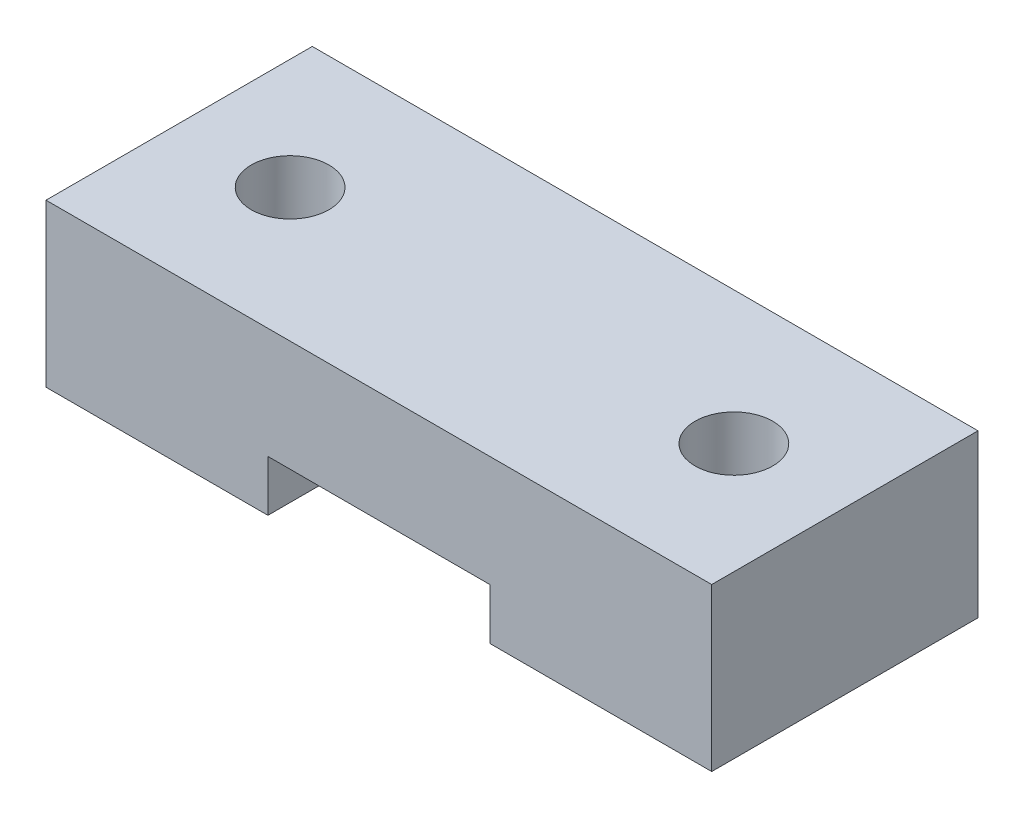
ISO-10303-21;
HEADER;
FILE_DESCRIPTION(('STEP AP214'),'2;1');
FILE_NAME('part.step','',(''),(''),'','','');
FILE_SCHEMA(('AUTOMOTIVE_DESIGN { 1 0 10303 214 1 1 1 1 }'));
ENDSEC;
DATA;
#1=APPLICATION_CONTEXT('core data for automotive mechanical design processes');
#2=APPLICATION_PROTOCOL_DEFINITION('international standard','automotive_design',2000,#1);
#3=PRODUCT_CONTEXT('',#1,'mechanical');
#4=PRODUCT('Part','Part','',(#3));
#5=PRODUCT_RELATED_PRODUCT_CATEGORY('part','',(#4));
#6=PRODUCT_DEFINITION_FORMATION('','',#4);
#7=PRODUCT_DEFINITION_CONTEXT('part definition',#1,'design');
#8=PRODUCT_DEFINITION('design','',#6,#7);
#9=PRODUCT_DEFINITION_SHAPE('','',#8);
#10=(LENGTH_UNIT() NAMED_UNIT(*) SI_UNIT(.MILLI.,.METRE.));
#11=(NAMED_UNIT(*) PLANE_ANGLE_UNIT() SI_UNIT($,.RADIAN.));
#12=(NAMED_UNIT(*) SI_UNIT($,.STERADIAN.) SOLID_ANGLE_UNIT());
#13=UNCERTAINTY_MEASURE_WITH_UNIT(LENGTH_MEASURE(1.E-05),#10,'distance_accuracy_value','');
#14=(GEOMETRIC_REPRESENTATION_CONTEXT(3) GLOBAL_UNCERTAINTY_ASSIGNED_CONTEXT((#13)) GLOBAL_UNIT_ASSIGNED_CONTEXT((#10,
#11,#12)) REPRESENTATION_CONTEXT('',''));
#15=CARTESIAN_POINT('',(0.,0.,0.));
#16=DIRECTION('',(0.,0.,1.));
#17=DIRECTION('',(1.,0.,0.));
#18=AXIS2_PLACEMENT_3D('',#15,#16,#17);
#19=CARTESIAN_POINT('',(0.,61.5,5.));
#20=DIRECTION('',(0.,-1.,0.));
#21=DIRECTION('',(0.,0.,-1.));
#22=AXIS2_PLACEMENT_3D('',#19,#20,#21);
#23=PLANE('',#22);
#24=CARTESIAN_POINT('',(25.,61.5,-25.));
#25=DIRECTION('',(0.,1.,0.));
#26=DIRECTION('',(0.,0.,-1.));
#27=AXIS2_PLACEMENT_3D('',#24,#25,#26);
#28=CIRCLE('',#27,1.75);
#29=CARTESIAN_POINT('',(25.,61.5,-26.75));
#30=VERTEX_POINT('',#29);
#31=EDGE_CURVE('E323',#30,#30,#28,.T.);
#32=ORIENTED_EDGE('',*,*,#31,.F.);
#33=EDGE_LOOP('',(#32));
#34=FACE_BOUND('',#33,.T.);
#35=CARTESIAN_POINT('',(5.,61.5,-25.));
#36=DIRECTION('',(0.,1.,0.));
#37=DIRECTION('',(0.,0.,1.));
#38=AXIS2_PLACEMENT_3D('',#35,#36,#37);
#39=CIRCLE('',#38,1.75);
#40=CARTESIAN_POINT('',(5.,61.5,-23.25));
#41=VERTEX_POINT('',#40);
#42=EDGE_CURVE('E324',#41,#41,#39,.T.);
#43=ORIENTED_EDGE('',*,*,#42,.F.);
#44=EDGE_LOOP('',(#43));
#45=FACE_BOUND('',#44,.T.);
#46=DIRECTION('',(-1.,0.,0.));
#47=VECTOR('',#46,1.);
#48=CARTESIAN_POINT('',(30.,61.5,-19.));
#49=LINE('',#48,#47);
#50=CARTESIAN_POINT('',(30.,61.5,-19.));
#51=VERTEX_POINT('',#50);
#52=CARTESIAN_POINT('',(0.,61.5,-19.));
#53=VERTEX_POINT('',#52);
#54=EDGE_CURVE('E176',#51,#53,#49,.T.);
#55=ORIENTED_EDGE('',*,*,#54,.F.);
#56=DIRECTION('',(0.,0.,-1.));
#57=VECTOR('',#56,1.);
#58=CARTESIAN_POINT('',(30.,61.5,5.));
#59=LINE('',#58,#57);
#60=CARTESIAN_POINT('',(30.,61.5,-31.));
#61=VERTEX_POINT('',#60);
#62=EDGE_CURVE('E12',#51,#61,#59,.T.);
#63=ORIENTED_EDGE('',*,*,#62,.T.);
#64=DIRECTION('',(-1.,0.,0.));
#65=VECTOR('',#64,1.);
#66=CARTESIAN_POINT('',(30.,61.5,-31.));
#67=LINE('',#66,#65);
#68=CARTESIAN_POINT('',(0.,61.5,-31.));
#69=VERTEX_POINT('',#68);
#70=EDGE_CURVE('E189',#61,#69,#67,.T.);
#71=ORIENTED_EDGE('',*,*,#70,.T.);
#72=DIRECTION('',(0.,0.,-1.));
#73=VECTOR('',#72,1.);
#74=CARTESIAN_POINT('',(0.,61.5,5.));
#75=LINE('',#74,#73);
#76=EDGE_CURVE('E42',#53,#69,#75,.T.);
#77=ORIENTED_EDGE('',*,*,#76,.F.);
#78=EDGE_LOOP('',(#55,#63,#71,#77));
#79=FACE_BOUND('',#78,.T.);
#80=ADVANCED_FACE('F33',(#34,#45,#79),#23,.F.);
#81=CARTESIAN_POINT('',(0.,56.5,0.));
#82=DIRECTION('',(0.,-1.,0.));
#83=DIRECTION('',(0.,0.,-1.));
#84=AXIS2_PLACEMENT_3D('',#81,#82,#83);
#85=PLANE('',#84);
#86=DIRECTION('',(0.,0.,-1.));
#87=VECTOR('',#86,1.);
#88=CARTESIAN_POINT('',(20.,56.5,-19.));
#89=LINE('',#88,#87);
#90=CARTESIAN_POINT('',(20.,56.5,-19.));
#91=VERTEX_POINT('',#90);
#92=CARTESIAN_POINT('',(20.,56.5,-31.));
#93=VERTEX_POINT('',#92);
#94=EDGE_CURVE('E247',#91,#93,#89,.T.);
#95=ORIENTED_EDGE('',*,*,#94,.F.);
#96=DIRECTION('',(-1.,0.,0.));
#97=VECTOR('',#96,1.);
#98=CARTESIAN_POINT('',(0.,56.5,-19.));
#99=LINE('',#98,#97);
#100=CARTESIAN_POINT('',(10.,56.5,-19.));
#101=VERTEX_POINT('',#100);
#102=EDGE_CURVE('E205',#91,#101,#99,.T.);
#103=ORIENTED_EDGE('',*,*,#102,.T.);
#104=DIRECTION('',(0.,0.,1.));
#105=VECTOR('',#104,1.);
#106=CARTESIAN_POINT('',(10.,56.5,-19.));
#107=LINE('',#106,#105);
#108=CARTESIAN_POINT('',(10.,56.5,-31.));
#109=VERTEX_POINT('',#108);
#110=EDGE_CURVE('E304',#109,#101,#107,.T.);
#111=ORIENTED_EDGE('',*,*,#110,.F.);
#112=DIRECTION('',(1.,0.,0.));
#113=VECTOR('',#112,1.);
#114=CARTESIAN_POINT('',(0.,56.5,-31.));
#115=LINE('',#114,#113);
#116=EDGE_CURVE('E202',#109,#93,#115,.T.);
#117=ORIENTED_EDGE('',*,*,#116,.T.);
#118=EDGE_LOOP('',(#95,#103,#111,#117));
#119=FACE_BOUND('',#118,.T.);
#120=ADVANCED_FACE('F345',(#119),#85,.T.);
#121=CARTESIAN_POINT('',(0.,0.,5.));
#122=DIRECTION('',(1.,0.,0.));
#123=DIRECTION('',(0.,0.,-1.));
#124=AXIS2_PLACEMENT_3D('',#121,#122,#123);
#125=PLANE('',#124);
#126=DIRECTION('',(0.,1.,0.));
#127=VECTOR('',#126,1.);
#128=CARTESIAN_POINT('',(0.,54.2,-19.));
#129=LINE('',#128,#127);
#130=CARTESIAN_POINT('',(0.,54.2,-19.));
#131=VERTEX_POINT('',#130);
#132=EDGE_CURVE('E314',#131,#53,#129,.T.);
#133=ORIENTED_EDGE('',*,*,#132,.T.);
#134=ORIENTED_EDGE('',*,*,#76,.T.);
#135=DIRECTION('',(0.,-1.,0.));
#136=VECTOR('',#135,1.);
#137=CARTESIAN_POINT('',(0.,54.2,-31.));
#138=LINE('',#137,#136);
#139=CARTESIAN_POINT('',(0.,54.2,-31.));
#140=VERTEX_POINT('',#139);
#141=EDGE_CURVE('E197',#69,#140,#138,.T.);
#142=ORIENTED_EDGE('',*,*,#141,.T.);
#143=DIRECTION('',(0.,0.,-1.));
#144=VECTOR('',#143,1.);
#145=CARTESIAN_POINT('',(0.,54.2,-19.));
#146=LINE('',#145,#144);
#147=EDGE_CURVE('E305',#131,#140,#146,.T.);
#148=ORIENTED_EDGE('',*,*,#147,.F.);
#149=EDGE_LOOP('',(#133,#134,#142,#148));
#150=FACE_BOUND('',#149,.T.);
#151=ADVANCED_FACE('F35',(#150),#125,.F.);
#152=CARTESIAN_POINT('',(30.,0.,5.));
#153=DIRECTION('',(-1.,0.,0.));
#154=DIRECTION('',(0.,0.,1.));
#155=AXIS2_PLACEMENT_3D('',#152,#153,#154);
#156=PLANE('',#155);
#157=ORIENTED_EDGE('',*,*,#62,.F.);
#158=DIRECTION('',(0.,1.,0.));
#159=VECTOR('',#158,1.);
#160=CARTESIAN_POINT('',(30.,54.2,-19.));
#161=LINE('',#160,#159);
#162=CARTESIAN_POINT('',(30.,54.2,-19.));
#163=VERTEX_POINT('',#162);
#164=EDGE_CURVE('E171',#163,#51,#161,.T.);
#165=ORIENTED_EDGE('',*,*,#164,.F.);
#166=DIRECTION('',(0.,0.,1.));
#167=VECTOR('',#166,1.);
#168=CARTESIAN_POINT('',(30.,54.2,-19.));
#169=LINE('',#168,#167);
#170=CARTESIAN_POINT('',(30.,54.2,-31.));
#171=VERTEX_POINT('',#170);
#172=EDGE_CURVE('E195',#171,#163,#169,.T.);
#173=ORIENTED_EDGE('',*,*,#172,.F.);
#174=DIRECTION('',(0.,-1.,0.));
#175=VECTOR('',#174,1.);
#176=CARTESIAN_POINT('',(30.,54.2,-31.));
#177=LINE('',#176,#175);
#178=EDGE_CURVE('E190',#61,#171,#177,.T.);
#179=ORIENTED_EDGE('',*,*,#178,.F.);
#180=EDGE_LOOP('',(#157,#165,#173,#179));
#181=FACE_BOUND('',#180,.T.);
#182=ADVANCED_FACE('F193',(#181),#156,.F.);
#183=DIRECTION('',(0.,0.,1.));
#184=VECTOR('',#183,1.);
#185=CARTESIAN_POINT('',(28.117691453624,56.5,-23.2));
#186=LINE('',#185,#184);
#187=CARTESIAN_POINT('',(28.117691453624,56.5,-26.8));
#188=VERTEX_POINT('',#187);
#189=CARTESIAN_POINT('',(28.117691453624,56.5,-23.2));
#190=VERTEX_POINT('',#189);
#191=EDGE_CURVE('E50',#188,#190,#186,.T.);
#192=ORIENTED_EDGE('',*,*,#191,.T.);
#193=DIRECTION('',(-0.866025403784439,0.,0.5));
#194=VECTOR('',#193,1.);
#195=CARTESIAN_POINT('',(25.,56.5,-21.4));
#196=LINE('',#195,#194);
#197=CARTESIAN_POINT('',(25.,56.5,-21.4));
#198=VERTEX_POINT('',#197);
#199=EDGE_CURVE('E54',#190,#198,#196,.T.);
#200=ORIENTED_EDGE('',*,*,#199,.T.);
#201=DIRECTION('',(-0.866025403784439,0.,-0.5));
#202=VECTOR('',#201,1.);
#203=CARTESIAN_POINT('',(21.882308546376,56.5,-23.2));
#204=LINE('',#203,#202);
#205=CARTESIAN_POINT('',(21.882308546376,56.5,-23.2));
#206=VERTEX_POINT('',#205);
#207=EDGE_CURVE('E224',#198,#206,#204,.T.);
#208=ORIENTED_EDGE('',*,*,#207,.T.);
#209=DIRECTION('',(0.,0.,-1.));
#210=VECTOR('',#209,1.);
#211=CARTESIAN_POINT('',(21.882308546376,56.5,-26.8));
#212=LINE('',#211,#210);
#213=CARTESIAN_POINT('',(21.882308546376,56.5,-26.8));
#214=VERTEX_POINT('',#213);
#215=EDGE_CURVE('E226',#206,#214,#212,.T.);
#216=ORIENTED_EDGE('',*,*,#215,.T.);
#217=DIRECTION('',(0.866025403784438,0.,-0.500000000000001));
#218=VECTOR('',#217,1.);
#219=CARTESIAN_POINT('',(25.,56.5,-28.6));
#220=LINE('',#219,#218);
#221=CARTESIAN_POINT('',(25.,56.5,-28.6));
#222=VERTEX_POINT('',#221);
#223=EDGE_CURVE('E228',#214,#222,#220,.T.);
#224=ORIENTED_EDGE('',*,*,#223,.T.);
#225=DIRECTION('',(0.866025403784439,0.,0.499999999999999));
#226=VECTOR('',#225,1.);
#227=CARTESIAN_POINT('',(28.117691453624,56.5,-26.8));
#228=LINE('',#227,#226);
#229=EDGE_CURVE('E210',#222,#188,#228,.T.);
#230=ORIENTED_EDGE('',*,*,#229,.T.);
#231=EDGE_LOOP('',(#192,#200,#208,#216,#224,#230));
#232=FACE_BOUND('',#231,.T.);
#233=CARTESIAN_POINT('',(25.,56.5,-25.));
#234=DIRECTION('',(0.,-1.,0.));
#235=DIRECTION('',(0.,0.,-1.));
#236=AXIS2_PLACEMENT_3D('',#233,#234,#235);
#237=CIRCLE('',#236,1.75);
#238=CARTESIAN_POINT('',(25.,56.5,-26.75));
#239=VERTEX_POINT('',#238);
#240=EDGE_CURVE('E327',#239,#239,#237,.T.);
#241=ORIENTED_EDGE('',*,*,#240,.F.);
#242=EDGE_LOOP('',(#241));
#243=FACE_BOUND('',#242,.T.);
#244=ADVANCED_FACE('F342',(#232,#243),#85,.T.);
#245=DIRECTION('',(0.866025403784439,0.,-0.499999999999999));
#246=VECTOR('',#245,1.);
#247=CARTESIAN_POINT('',(1.88230854637602,56.5,-26.8));
#248=LINE('',#247,#246);
#249=CARTESIAN_POINT('',(1.88230854637602,56.5,-26.8));
#250=VERTEX_POINT('',#249);
#251=CARTESIAN_POINT('',(5.00000000000001,56.5,-28.6));
#252=VERTEX_POINT('',#251);
#253=EDGE_CURVE('E261',#250,#252,#248,.T.);
#254=ORIENTED_EDGE('',*,*,#253,.T.);
#255=DIRECTION('',(0.866025403784438,0.,0.500000000000001));
#256=VECTOR('',#255,1.);
#257=CARTESIAN_POINT('',(5.,56.5,-28.6));
#258=LINE('',#257,#256);
#259=CARTESIAN_POINT('',(8.11769145362398,56.5,-26.8));
#260=VERTEX_POINT('',#259);
#261=EDGE_CURVE('E278',#252,#260,#258,.T.);
#262=ORIENTED_EDGE('',*,*,#261,.T.);
#263=DIRECTION('',(0.,0.,1.));
#264=VECTOR('',#263,1.);
#265=CARTESIAN_POINT('',(8.11769145362398,56.5,-26.8));
#266=LINE('',#265,#264);
#267=CARTESIAN_POINT('',(8.11769145362397,56.5,-23.2));
#268=VERTEX_POINT('',#267);
#269=EDGE_CURVE('E280',#260,#268,#266,.T.);
#270=ORIENTED_EDGE('',*,*,#269,.T.);
#271=DIRECTION('',(-0.866025403784439,0.,0.499999999999999));
#272=VECTOR('',#271,1.);
#273=CARTESIAN_POINT('',(8.11769145362398,56.5,-23.2));
#274=LINE('',#273,#272);
#275=CARTESIAN_POINT('',(5.,56.5,-21.4));
#276=VERTEX_POINT('',#275);
#277=EDGE_CURVE('E282',#268,#276,#274,.T.);
#278=ORIENTED_EDGE('',*,*,#277,.T.);
#279=DIRECTION('',(-0.866025403784439,0.,-0.5));
#280=VECTOR('',#279,1.);
#281=CARTESIAN_POINT('',(5.,56.5,-21.4));
#282=LINE('',#281,#280);
#283=CARTESIAN_POINT('',(1.88230854637603,56.5,-23.2));
#284=VERTEX_POINT('',#283);
#285=EDGE_CURVE('E284',#276,#284,#282,.T.);
#286=ORIENTED_EDGE('',*,*,#285,.T.);
#287=DIRECTION('',(0.,0.,-1.));
#288=VECTOR('',#287,1.);
#289=CARTESIAN_POINT('',(1.88230854637603,56.5,-23.2));
#290=LINE('',#289,#288);
#291=EDGE_CURVE('E265',#284,#250,#290,.T.);
#292=ORIENTED_EDGE('',*,*,#291,.T.);
#293=EDGE_LOOP('',(#254,#262,#270,#278,#286,#292));
#294=FACE_BOUND('',#293,.T.);
#295=CARTESIAN_POINT('',(5.,56.5,-25.));
#296=DIRECTION('',(0.,-1.,0.));
#297=DIRECTION('',(0.,0.,-1.));
#298=AXIS2_PLACEMENT_3D('',#295,#296,#297);
#299=CIRCLE('',#298,1.75);
#300=CARTESIAN_POINT('',(5.,56.5,-26.75));
#301=VERTEX_POINT('',#300);
#302=EDGE_CURVE('E37',#301,#301,#299,.T.);
#303=ORIENTED_EDGE('',*,*,#302,.F.);
#304=EDGE_LOOP('',(#303));
#305=FACE_BOUND('',#304,.T.);
#306=ADVANCED_FACE('F339',(#294,#305),#85,.T.);
#307=CARTESIAN_POINT('',(25.,0.,-25.));
#308=DIRECTION('',(0.,1.,0.));
#309=DIRECTION('',(0.,0.,1.));
#310=AXIS2_PLACEMENT_3D('',#307,#308,#309);
#311=CYLINDRICAL_SURFACE('',#310,1.75);
#312=ORIENTED_EDGE('',*,*,#240,.T.);
#313=EDGE_LOOP('',(#312));
#314=FACE_BOUND('',#313,.T.);
#315=ORIENTED_EDGE('',*,*,#31,.T.);
#316=EDGE_LOOP('',(#315));
#317=FACE_BOUND('',#316,.T.);
#318=ADVANCED_FACE('F341',(#314,#317),#311,.F.);
#319=CARTESIAN_POINT('',(5.,0.,-25.));
#320=DIRECTION('',(0.,1.,0.));
#321=DIRECTION('',(0.,0.,1.));
#322=AXIS2_PLACEMENT_3D('',#319,#320,#321);
#323=CYLINDRICAL_SURFACE('',#322,1.75);
#324=ORIENTED_EDGE('',*,*,#302,.T.);
#325=EDGE_LOOP('',(#324));
#326=FACE_BOUND('',#325,.T.);
#327=ORIENTED_EDGE('',*,*,#42,.T.);
#328=EDGE_LOOP('',(#327));
#329=FACE_BOUND('',#328,.T.);
#330=ADVANCED_FACE('F336',(#326,#329),#323,.F.);
#331=CARTESIAN_POINT('',(0.,54.2,0.));
#332=DIRECTION('',(0.,1.,0.));
#333=DIRECTION('',(0.,0.,1.));
#334=AXIS2_PLACEMENT_3D('',#331,#332,#333);
#335=PLANE('',#334);
#336=ORIENTED_EDGE('',*,*,#147,.T.);
#337=DIRECTION('',(1.,0.,0.));
#338=VECTOR('',#337,1.);
#339=CARTESIAN_POINT('',(10.,54.2,-31.));
#340=LINE('',#339,#338);
#341=CARTESIAN_POINT('',(10.,54.2,-31.));
#342=VERTEX_POINT('',#341);
#343=EDGE_CURVE('E308',#140,#342,#340,.T.);
#344=ORIENTED_EDGE('',*,*,#343,.T.);
#345=DIRECTION('',(0.,0.,1.));
#346=VECTOR('',#345,1.);
#347=CARTESIAN_POINT('',(10.,54.2,-19.));
#348=LINE('',#347,#346);
#349=CARTESIAN_POINT('',(10.,54.2,-19.));
#350=VERTEX_POINT('',#349);
#351=EDGE_CURVE('E310',#342,#350,#348,.T.);
#352=ORIENTED_EDGE('',*,*,#351,.T.);
#353=DIRECTION('',(-1.,0.,0.));
#354=VECTOR('',#353,1.);
#355=CARTESIAN_POINT('',(10.,54.2,-19.));
#356=LINE('',#355,#354);
#357=EDGE_CURVE('E312',#350,#131,#356,.T.);
#358=ORIENTED_EDGE('',*,*,#357,.T.);
#359=EDGE_LOOP('',(#336,#344,#352,#358));
#360=FACE_BOUND('',#359,.T.);
#361=DIRECTION('',(0.866025403784439,0.,-0.499999999999999));
#362=VECTOR('',#361,1.);
#363=CARTESIAN_POINT('',(1.88230854637602,54.2,-26.8));
#364=LINE('',#363,#362);
#365=CARTESIAN_POINT('',(1.88230854637602,54.2,-26.8));
#366=VERTEX_POINT('',#365);
#367=CARTESIAN_POINT('',(5.,54.2,-28.6));
#368=VERTEX_POINT('',#367);
#369=EDGE_CURVE('E262',#366,#368,#364,.T.);
#370=ORIENTED_EDGE('',*,*,#369,.F.);
#371=DIRECTION('',(0.,0.,-1.));
#372=VECTOR('',#371,1.);
#373=CARTESIAN_POINT('',(1.88230854637603,54.2,-23.2));
#374=LINE('',#373,#372);
#375=CARTESIAN_POINT('',(1.88230854637603,54.2,-23.2));
#376=VERTEX_POINT('',#375);
#377=EDGE_CURVE('E274',#376,#366,#374,.T.);
#378=ORIENTED_EDGE('',*,*,#377,.F.);
#379=DIRECTION('',(-0.866025403784439,0.,-0.5));
#380=VECTOR('',#379,1.);
#381=CARTESIAN_POINT('',(5.,54.2,-21.4));
#382=LINE('',#381,#380);
#383=CARTESIAN_POINT('',(5.,54.2,-21.4));
#384=VERTEX_POINT('',#383);
#385=EDGE_CURVE('E271',#384,#376,#382,.T.);
#386=ORIENTED_EDGE('',*,*,#385,.F.);
#387=DIRECTION('',(-0.866025403784439,0.,0.499999999999999));
#388=VECTOR('',#387,1.);
#389=CARTESIAN_POINT('',(8.11769145362398,54.2,-23.2));
#390=LINE('',#389,#388);
#391=CARTESIAN_POINT('',(8.11769145362398,54.2,-23.2));
#392=VERTEX_POINT('',#391);
#393=EDGE_CURVE('E269',#392,#384,#390,.T.);
#394=ORIENTED_EDGE('',*,*,#393,.F.);
#395=DIRECTION('',(0.,0.,1.));
#396=VECTOR('',#395,1.);
#397=CARTESIAN_POINT('',(8.11769145362398,54.2,-26.8));
#398=LINE('',#397,#396);
#399=CARTESIAN_POINT('',(8.11769145362398,54.2,-26.8));
#400=VERTEX_POINT('',#399);
#401=EDGE_CURVE('E267',#400,#392,#398,.T.);
#402=ORIENTED_EDGE('',*,*,#401,.F.);
#403=DIRECTION('',(0.866025403784438,0.,0.500000000000001));
#404=VECTOR('',#403,1.);
#405=CARTESIAN_POINT('',(5.,54.2,-28.6));
#406=LINE('',#405,#404);
#407=EDGE_CURVE('E264',#368,#400,#406,.T.);
#408=ORIENTED_EDGE('',*,*,#407,.F.);
#409=EDGE_LOOP('',(#370,#378,#386,#394,#402,#408));
#410=FACE_BOUND('',#409,.T.);
#411=ADVANCED_FACE('F371',(#360,#410),#335,.F.);
#412=CARTESIAN_POINT('',(10.,54.2,-31.));
#413=DIRECTION('',(0.,0.,1.));
#414=DIRECTION('',(1.,0.,0.));
#415=AXIS2_PLACEMENT_3D('',#412,#413,#414);
#416=PLANE('',#415);
#417=ORIENTED_EDGE('',*,*,#116,.F.);
#418=DIRECTION('',(0.,1.,0.));
#419=VECTOR('',#418,1.);
#420=CARTESIAN_POINT('',(10.,54.2,-31.));
#421=LINE('',#420,#419);
#422=EDGE_CURVE('E320',#342,#109,#421,.T.);
#423=ORIENTED_EDGE('',*,*,#422,.F.);
#424=ORIENTED_EDGE('',*,*,#343,.F.);
#425=ORIENTED_EDGE('',*,*,#141,.F.);
#426=ORIENTED_EDGE('',*,*,#70,.F.);
#427=ORIENTED_EDGE('',*,*,#178,.T.);
#428=DIRECTION('',(1.,0.,0.));
#429=VECTOR('',#428,1.);
#430=CARTESIAN_POINT('',(20.,54.2,-31.));
#431=LINE('',#430,#429);
#432=CARTESIAN_POINT('',(20.,54.2,-31.));
#433=VERTEX_POINT('',#432);
#434=EDGE_CURVE('E251',#433,#171,#431,.T.);
#435=ORIENTED_EDGE('',*,*,#434,.F.);
#436=DIRECTION('',(0.,1.,0.));
#437=VECTOR('',#436,1.);
#438=CARTESIAN_POINT('',(20.,54.2,-31.));
#439=LINE('',#438,#437);
#440=EDGE_CURVE('E183',#433,#93,#439,.T.);
#441=ORIENTED_EDGE('',*,*,#440,.T.);
#442=EDGE_LOOP('',(#417,#423,#424,#425,#426,#427,#435,#441));
#443=FACE_BOUND('',#442,.T.);
#444=ADVANCED_FACE('F386',(#443),#416,.F.);
#445=CARTESIAN_POINT('',(10.,54.2,-19.));
#446=DIRECTION('',(-1.,0.,0.));
#447=DIRECTION('',(0.,0.,1.));
#448=AXIS2_PLACEMENT_3D('',#445,#446,#447);
#449=PLANE('',#448);
#450=ORIENTED_EDGE('',*,*,#110,.T.);
#451=DIRECTION('',(0.,1.,0.));
#452=VECTOR('',#451,1.);
#453=CARTESIAN_POINT('',(10.,54.2,-19.));
#454=LINE('',#453,#452);
#455=EDGE_CURVE('E318',#350,#101,#454,.T.);
#456=ORIENTED_EDGE('',*,*,#455,.F.);
#457=ORIENTED_EDGE('',*,*,#351,.F.);
#458=ORIENTED_EDGE('',*,*,#422,.T.);
#459=EDGE_LOOP('',(#450,#456,#457,#458));
#460=FACE_BOUND('',#459,.T.);
#461=ADVANCED_FACE('F376',(#460),#449,.F.);
#462=CARTESIAN_POINT('',(10.,54.2,-19.));
#463=DIRECTION('',(0.,0.,-1.));
#464=DIRECTION('',(-1.,0.,0.));
#465=AXIS2_PLACEMENT_3D('',#462,#463,#464);
#466=PLANE('',#465);
#467=ORIENTED_EDGE('',*,*,#455,.T.);
#468=ORIENTED_EDGE('',*,*,#102,.F.);
#469=DIRECTION('',(0.,1.,0.));
#470=VECTOR('',#469,1.);
#471=CARTESIAN_POINT('',(20.,54.2,-19.));
#472=LINE('',#471,#470);
#473=CARTESIAN_POINT('',(20.,54.2,-19.));
#474=VERTEX_POINT('',#473);
#475=EDGE_CURVE('E184',#474,#91,#472,.T.);
#476=ORIENTED_EDGE('',*,*,#475,.F.);
#477=DIRECTION('',(-1.,0.,0.));
#478=VECTOR('',#477,1.);
#479=CARTESIAN_POINT('',(20.,54.2,-19.));
#480=LINE('',#479,#478);
#481=EDGE_CURVE('E179',#163,#474,#480,.T.);
#482=ORIENTED_EDGE('',*,*,#481,.F.);
#483=ORIENTED_EDGE('',*,*,#164,.T.);
#484=ORIENTED_EDGE('',*,*,#54,.T.);
#485=ORIENTED_EDGE('',*,*,#132,.F.);
#486=ORIENTED_EDGE('',*,*,#357,.F.);
#487=EDGE_LOOP('',(#467,#468,#476,#482,#483,#484,#485,#486));
#488=FACE_BOUND('',#487,.T.);
#489=ADVANCED_FACE('F174',(#488),#466,.F.);
#490=CARTESIAN_POINT('',(1.88230854637602,54.2,-26.8));
#491=DIRECTION('',(0.499999999999999,0.,0.866025403784439));
#492=DIRECTION('',(0.866025403784439,0.,-0.499999999999999));
#493=AXIS2_PLACEMENT_3D('',#490,#491,#492);
#494=PLANE('',#493);
#495=ORIENTED_EDGE('',*,*,#253,.F.);
#496=DIRECTION('',(0.,1.,0.));
#497=VECTOR('',#496,1.);
#498=CARTESIAN_POINT('',(1.88230854637602,54.2,-26.8));
#499=LINE('',#498,#497);
#500=EDGE_CURVE('E276',#366,#250,#499,.T.);
#501=ORIENTED_EDGE('',*,*,#500,.F.);
#502=ORIENTED_EDGE('',*,*,#369,.T.);
#503=DIRECTION('',(0.,1.,0.));
#504=VECTOR('',#503,1.);
#505=CARTESIAN_POINT('',(5.,54.2,-28.6));
#506=LINE('',#505,#504);
#507=EDGE_CURVE('E301',#368,#252,#506,.T.);
#508=ORIENTED_EDGE('',*,*,#507,.T.);
#509=EDGE_LOOP('',(#495,#501,#502,#508));
#510=FACE_BOUND('',#509,.T.);
#511=ADVANCED_FACE('F433',(#510),#494,.T.);
#512=CARTESIAN_POINT('',(5.,54.2,-28.6));
#513=DIRECTION('',(-0.500000000000001,0.,0.866025403784438));
#514=DIRECTION('',(0.866025403784438,0.,0.500000000000001));
#515=AXIS2_PLACEMENT_3D('',#512,#513,#514);
#516=PLANE('',#515);
#517=ORIENTED_EDGE('',*,*,#261,.F.);
#518=ORIENTED_EDGE('',*,*,#507,.F.);
#519=ORIENTED_EDGE('',*,*,#407,.T.);
#520=DIRECTION('',(0.,1.,0.));
#521=VECTOR('',#520,1.);
#522=CARTESIAN_POINT('',(8.11769145362398,54.2,-26.8));
#523=LINE('',#522,#521);
#524=EDGE_CURVE('E298',#400,#260,#523,.T.);
#525=ORIENTED_EDGE('',*,*,#524,.T.);
#526=EDGE_LOOP('',(#517,#518,#519,#525));
#527=FACE_BOUND('',#526,.T.);
#528=ADVANCED_FACE('F563',(#527),#516,.T.);
#529=CARTESIAN_POINT('',(8.11769145362398,54.2,-26.8));
#530=DIRECTION('',(-1.,0.,0.));
#531=DIRECTION('',(0.,0.,1.));
#532=AXIS2_PLACEMENT_3D('',#529,#530,#531);
#533=PLANE('',#532);
#534=ORIENTED_EDGE('',*,*,#269,.F.);
#535=ORIENTED_EDGE('',*,*,#524,.F.);
#536=ORIENTED_EDGE('',*,*,#401,.T.);
#537=DIRECTION('',(0.,1.,0.));
#538=VECTOR('',#537,1.);
#539=CARTESIAN_POINT('',(8.11769145362398,54.2,-23.2));
#540=LINE('',#539,#538);
#541=EDGE_CURVE('E295',#392,#268,#540,.T.);
#542=ORIENTED_EDGE('',*,*,#541,.T.);
#543=EDGE_LOOP('',(#534,#535,#536,#542));
#544=FACE_BOUND('',#543,.T.);
#545=ADVANCED_FACE('F572',(#544),#533,.T.);
#546=CARTESIAN_POINT('',(8.11769145362398,54.2,-23.2));
#547=DIRECTION('',(-0.499999999999999,0.,-0.866025403784439));
#548=DIRECTION('',(-0.866025403784439,0.,0.499999999999999));
#549=AXIS2_PLACEMENT_3D('',#546,#547,#548);
#550=PLANE('',#549);
#551=ORIENTED_EDGE('',*,*,#277,.F.);
#552=ORIENTED_EDGE('',*,*,#541,.F.);
#553=ORIENTED_EDGE('',*,*,#393,.T.);
#554=DIRECTION('',(0.,1.,0.));
#555=VECTOR('',#554,1.);
#556=CARTESIAN_POINT('',(5.,54.2,-21.4));
#557=LINE('',#556,#555);
#558=EDGE_CURVE('E292',#384,#276,#557,.T.);
#559=ORIENTED_EDGE('',*,*,#558,.T.);
#560=EDGE_LOOP('',(#551,#552,#553,#559));
#561=FACE_BOUND('',#560,.T.);
#562=ADVANCED_FACE('F581',(#561),#550,.T.);
#563=CARTESIAN_POINT('',(5.,54.2,-21.4));
#564=DIRECTION('',(0.5,0.,-0.866025403784439));
#565=DIRECTION('',(-0.866025403784439,0.,-0.5));
#566=AXIS2_PLACEMENT_3D('',#563,#564,#565);
#567=PLANE('',#566);
#568=ORIENTED_EDGE('',*,*,#285,.F.);
#569=ORIENTED_EDGE('',*,*,#558,.F.);
#570=ORIENTED_EDGE('',*,*,#385,.T.);
#571=DIRECTION('',(0.,1.,0.));
#572=VECTOR('',#571,1.);
#573=CARTESIAN_POINT('',(1.88230854637603,54.2,-23.2));
#574=LINE('',#573,#572);
#575=EDGE_CURVE('E289',#376,#284,#574,.T.);
#576=ORIENTED_EDGE('',*,*,#575,.T.);
#577=EDGE_LOOP('',(#568,#569,#570,#576));
#578=FACE_BOUND('',#577,.T.);
#579=ADVANCED_FACE('F590',(#578),#567,.T.);
#580=CARTESIAN_POINT('',(1.88230854637603,54.2,-23.2));
#581=DIRECTION('',(1.,0.,0.));
#582=DIRECTION('',(0.,0.,-1.));
#583=AXIS2_PLACEMENT_3D('',#580,#581,#582);
#584=PLANE('',#583);
#585=ORIENTED_EDGE('',*,*,#291,.F.);
#586=ORIENTED_EDGE('',*,*,#575,.F.);
#587=ORIENTED_EDGE('',*,*,#377,.T.);
#588=ORIENTED_EDGE('',*,*,#500,.T.);
#589=EDGE_LOOP('',(#585,#586,#587,#588));
#590=FACE_BOUND('',#589,.T.);
#591=ADVANCED_FACE('F442',(#590),#584,.T.);
#592=CARTESIAN_POINT('',(0.,54.2,0.));
#593=DIRECTION('',(0.,-1.,0.));
#594=DIRECTION('',(0.,0.,-1.));
#595=AXIS2_PLACEMENT_3D('',#592,#593,#594);
#596=PLANE('',#595);
#597=DIRECTION('',(0.,0.,-1.));
#598=VECTOR('',#597,1.);
#599=CARTESIAN_POINT('',(20.,54.2,-19.));
#600=LINE('',#599,#598);
#601=EDGE_CURVE('E248',#474,#433,#600,.T.);
#602=ORIENTED_EDGE('',*,*,#601,.T.);
#603=ORIENTED_EDGE('',*,*,#434,.T.);
#604=ORIENTED_EDGE('',*,*,#172,.T.);
#605=ORIENTED_EDGE('',*,*,#481,.T.);
#606=EDGE_LOOP('',(#602,#603,#604,#605));
#607=FACE_BOUND('',#606,.T.);
#608=DIRECTION('',(-0.866025403784439,0.,0.5));
#609=VECTOR('',#608,1.);
#610=CARTESIAN_POINT('',(25.,54.2,-21.4));
#611=LINE('',#610,#609);
#612=CARTESIAN_POINT('',(28.117691453624,54.2,-23.2));
#613=VERTEX_POINT('',#612);
#614=CARTESIAN_POINT('',(25.,54.2,-21.4));
#615=VERTEX_POINT('',#614);
#616=EDGE_CURVE('E209',#613,#615,#611,.T.);
#617=ORIENTED_EDGE('',*,*,#616,.F.);
#618=DIRECTION('',(0.,0.,1.));
#619=VECTOR('',#618,1.);
#620=CARTESIAN_POINT('',(28.117691453624,54.2,-23.2));
#621=LINE('',#620,#619);
#622=CARTESIAN_POINT('',(28.117691453624,54.2,-26.8));
#623=VERTEX_POINT('',#622);
#624=EDGE_CURVE('E207',#623,#613,#621,.T.);
#625=ORIENTED_EDGE('',*,*,#624,.F.);
#626=DIRECTION('',(0.866025403784439,0.,0.499999999999999));
#627=VECTOR('',#626,1.);
#628=CARTESIAN_POINT('',(28.117691453624,54.2,-26.8));
#629=LINE('',#628,#627);
#630=CARTESIAN_POINT('',(25.,54.2,-28.6));
#631=VERTEX_POINT('',#630);
#632=EDGE_CURVE('E219',#631,#623,#629,.T.);
#633=ORIENTED_EDGE('',*,*,#632,.F.);
#634=DIRECTION('',(0.866025403784438,0.,-0.500000000000001));
#635=VECTOR('',#634,1.);
#636=CARTESIAN_POINT('',(25.,54.2,-28.6));
#637=LINE('',#636,#635);
#638=CARTESIAN_POINT('',(21.882308546376,54.2,-26.8));
#639=VERTEX_POINT('',#638);
#640=EDGE_CURVE('E216',#639,#631,#637,.T.);
#641=ORIENTED_EDGE('',*,*,#640,.F.);
#642=DIRECTION('',(0.,0.,-1.));
#643=VECTOR('',#642,1.);
#644=CARTESIAN_POINT('',(21.882308546376,54.2,-26.8));
#645=LINE('',#644,#643);
#646=CARTESIAN_POINT('',(21.882308546376,54.2,-23.2));
#647=VERTEX_POINT('',#646);
#648=EDGE_CURVE('E214',#647,#639,#645,.T.);
#649=ORIENTED_EDGE('',*,*,#648,.F.);
#650=DIRECTION('',(-0.866025403784439,0.,-0.5));
#651=VECTOR('',#650,1.);
#652=CARTESIAN_POINT('',(21.882308546376,54.2,-23.2));
#653=LINE('',#652,#651);
#654=EDGE_CURVE('E212',#615,#647,#653,.T.);
#655=ORIENTED_EDGE('',*,*,#654,.F.);
#656=EDGE_LOOP('',(#617,#625,#633,#641,#649,#655));
#657=FACE_BOUND('',#656,.T.);
#658=ADVANCED_FACE('F384',(#607,#657),#596,.T.);
#659=CARTESIAN_POINT('',(20.,54.2,-19.));
#660=DIRECTION('',(1.,0.,0.));
#661=DIRECTION('',(0.,0.,-1.));
#662=AXIS2_PLACEMENT_3D('',#659,#660,#661);
#663=PLANE('',#662);
#664=ORIENTED_EDGE('',*,*,#94,.T.);
#665=ORIENTED_EDGE('',*,*,#440,.F.);
#666=ORIENTED_EDGE('',*,*,#601,.F.);
#667=ORIENTED_EDGE('',*,*,#475,.T.);
#668=EDGE_LOOP('',(#664,#665,#666,#667));
#669=FACE_BOUND('',#668,.T.);
#670=ADVANCED_FACE('F381',(#669),#663,.F.);
#671=CARTESIAN_POINT('',(28.117691453624,54.2,-23.2));
#672=DIRECTION('',(-1.,0.,0.));
#673=DIRECTION('',(0.,0.,1.));
#674=AXIS2_PLACEMENT_3D('',#671,#672,#673);
#675=PLANE('',#674);
#676=ORIENTED_EDGE('',*,*,#191,.F.);
#677=DIRECTION('',(0.,1.,0.));
#678=VECTOR('',#677,1.);
#679=CARTESIAN_POINT('',(28.117691453624,54.2,-26.8));
#680=LINE('',#679,#678);
#681=EDGE_CURVE('E221',#623,#188,#680,.T.);
#682=ORIENTED_EDGE('',*,*,#681,.F.);
#683=ORIENTED_EDGE('',*,*,#624,.T.);
#684=DIRECTION('',(0.,1.,0.));
#685=VECTOR('',#684,1.);
#686=CARTESIAN_POINT('',(28.117691453624,54.2,-23.2));
#687=LINE('',#686,#685);
#688=EDGE_CURVE('E244',#613,#190,#687,.T.);
#689=ORIENTED_EDGE('',*,*,#688,.T.);
#690=EDGE_LOOP('',(#676,#682,#683,#689));
#691=FACE_BOUND('',#690,.T.);
#692=ADVANCED_FACE('F452',(#691),#675,.T.);
#693=CARTESIAN_POINT('',(25.,54.2,-21.4));
#694=DIRECTION('',(-0.5,0.,-0.866025403784439));
#695=DIRECTION('',(-0.866025403784439,0.,0.5));
#696=AXIS2_PLACEMENT_3D('',#693,#694,#695);
#697=PLANE('',#696);
#698=ORIENTED_EDGE('',*,*,#199,.F.);
#699=ORIENTED_EDGE('',*,*,#688,.F.);
#700=ORIENTED_EDGE('',*,*,#616,.T.);
#701=DIRECTION('',(0.,1.,0.));
#702=VECTOR('',#701,1.);
#703=CARTESIAN_POINT('',(25.,54.2,-21.4));
#704=LINE('',#703,#702);
#705=EDGE_CURVE('E242',#615,#198,#704,.T.);
#706=ORIENTED_EDGE('',*,*,#705,.T.);
#707=EDGE_LOOP('',(#698,#699,#700,#706));
#708=FACE_BOUND('',#707,.T.);
#709=ADVANCED_FACE('F462',(#708),#697,.T.);
#710=CARTESIAN_POINT('',(21.882308546376,54.2,-23.2));
#711=DIRECTION('',(0.5,0.,-0.866025403784439));
#712=DIRECTION('',(-0.866025403784439,0.,-0.5));
#713=AXIS2_PLACEMENT_3D('',#710,#711,#712);
#714=PLANE('',#713);
#715=ORIENTED_EDGE('',*,*,#207,.F.);
#716=ORIENTED_EDGE('',*,*,#705,.F.);
#717=ORIENTED_EDGE('',*,*,#654,.T.);
#718=DIRECTION('',(0.,1.,0.));
#719=VECTOR('',#718,1.);
#720=CARTESIAN_POINT('',(21.882308546376,54.2,-23.2));
#721=LINE('',#720,#719);
#722=EDGE_CURVE('E239',#647,#206,#721,.T.);
#723=ORIENTED_EDGE('',*,*,#722,.T.);
#724=EDGE_LOOP('',(#715,#716,#717,#723));
#725=FACE_BOUND('',#724,.T.);
#726=ADVANCED_FACE('F470',(#725),#714,.T.);
#727=CARTESIAN_POINT('',(21.882308546376,54.2,-26.8));
#728=DIRECTION('',(1.,0.,0.));
#729=DIRECTION('',(0.,0.,-1.));
#730=AXIS2_PLACEMENT_3D('',#727,#728,#729);
#731=PLANE('',#730);
#732=ORIENTED_EDGE('',*,*,#215,.F.);
#733=ORIENTED_EDGE('',*,*,#722,.F.);
#734=ORIENTED_EDGE('',*,*,#648,.T.);
#735=DIRECTION('',(0.,1.,0.));
#736=VECTOR('',#735,1.);
#737=CARTESIAN_POINT('',(21.882308546376,54.2,-26.8));
#738=LINE('',#737,#736);
#739=EDGE_CURVE('E236',#639,#214,#738,.T.);
#740=ORIENTED_EDGE('',*,*,#739,.T.);
#741=EDGE_LOOP('',(#732,#733,#734,#740));
#742=FACE_BOUND('',#741,.T.);
#743=ADVANCED_FACE('F478',(#742),#731,.T.);
#744=CARTESIAN_POINT('',(25.,54.2,-28.6));
#745=DIRECTION('',(0.500000000000001,0.,0.866025403784438));
#746=DIRECTION('',(0.866025403784438,0.,-0.500000000000001));
#747=AXIS2_PLACEMENT_3D('',#744,#745,#746);
#748=PLANE('',#747);
#749=ORIENTED_EDGE('',*,*,#223,.F.);
#750=ORIENTED_EDGE('',*,*,#739,.F.);
#751=ORIENTED_EDGE('',*,*,#640,.T.);
#752=DIRECTION('',(0.,1.,0.));
#753=VECTOR('',#752,1.);
#754=CARTESIAN_POINT('',(25.,54.2,-28.6));
#755=LINE('',#754,#753);
#756=EDGE_CURVE('E233',#631,#222,#755,.T.);
#757=ORIENTED_EDGE('',*,*,#756,.T.);
#758=EDGE_LOOP('',(#749,#750,#751,#757));
#759=FACE_BOUND('',#758,.T.);
#760=ADVANCED_FACE('F486',(#759),#748,.T.);
#761=CARTESIAN_POINT('',(28.117691453624,54.2,-26.8));
#762=DIRECTION('',(-0.499999999999999,0.,0.866025403784439));
#763=DIRECTION('',(0.866025403784439,0.,0.499999999999999));
#764=AXIS2_PLACEMENT_3D('',#761,#762,#763);
#765=PLANE('',#764);
#766=ORIENTED_EDGE('',*,*,#229,.F.);
#767=ORIENTED_EDGE('',*,*,#756,.F.);
#768=ORIENTED_EDGE('',*,*,#632,.T.);
#769=ORIENTED_EDGE('',*,*,#681,.T.);
#770=EDGE_LOOP('',(#766,#767,#768,#769));
#771=FACE_BOUND('',#770,.T.);
#772=ADVANCED_FACE('F494',(#771),#765,.T.);
#773=CLOSED_SHELL('',(#80,#120,#151,#182,#244,#306,#318,#330,#411,#444,#461,#489,#511,#528,#545,
#562,#579,#591,#658,#670,#692,#709,#726,#743,#760,#772));
#774=MANIFOLD_SOLID_BREP('B2',#773);
#775=ADVANCED_BREP_SHAPE_REPRESENTATION('',(#18,#774),#14);
#776=SHAPE_DEFINITION_REPRESENTATION(#9,#775);
ENDSEC;
END-ISO-10303-21;
